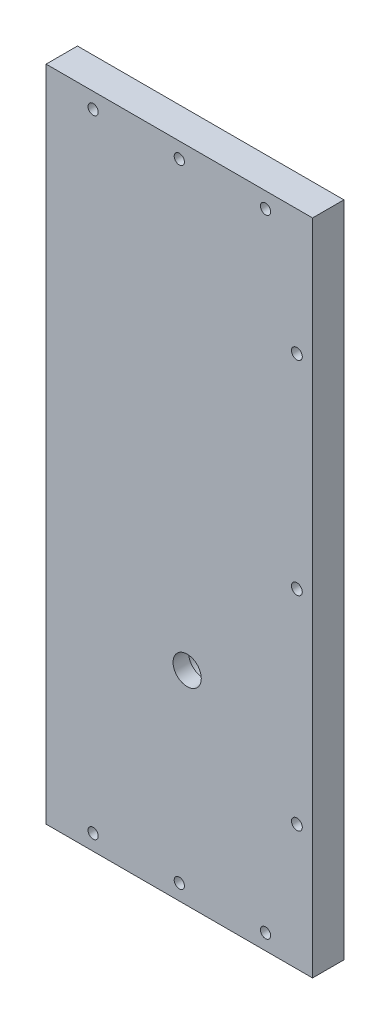
ISO-10303-21;
HEADER;
FILE_DESCRIPTION(('STEP AP214'),'2;1');
FILE_NAME('part.step','',(''),(''),'','','');
FILE_SCHEMA(('AUTOMOTIVE_DESIGN { 1 0 10303 214 1 1 1 1 }'));
ENDSEC;
DATA;
#1=APPLICATION_CONTEXT('core data for automotive mechanical design processes');
#2=APPLICATION_PROTOCOL_DEFINITION('international standard','automotive_design',2000,#1);
#3=PRODUCT_CONTEXT('',#1,'mechanical');
#4=PRODUCT('Part','Part','',(#3));
#5=PRODUCT_RELATED_PRODUCT_CATEGORY('part','',(#4));
#6=PRODUCT_DEFINITION_FORMATION('','',#4);
#7=PRODUCT_DEFINITION_CONTEXT('part definition',#1,'design');
#8=PRODUCT_DEFINITION('design','',#6,#7);
#9=PRODUCT_DEFINITION_SHAPE('','',#8);
#10=(LENGTH_UNIT() NAMED_UNIT(*) SI_UNIT(.MILLI.,.METRE.));
#11=(NAMED_UNIT(*) PLANE_ANGLE_UNIT() SI_UNIT($,.RADIAN.));
#12=(NAMED_UNIT(*) SI_UNIT($,.STERADIAN.) SOLID_ANGLE_UNIT());
#13=UNCERTAINTY_MEASURE_WITH_UNIT(LENGTH_MEASURE(1.E-05),#10,'distance_accuracy_value','');
#14=(GEOMETRIC_REPRESENTATION_CONTEXT(3) GLOBAL_UNCERTAINTY_ASSIGNED_CONTEXT((#13)) GLOBAL_UNIT_ASSIGNED_CONTEXT((#10,
#11,#12)) REPRESENTATION_CONTEXT('',''));
#15=CARTESIAN_POINT('',(0.,0.,0.));
#16=DIRECTION('',(0.,0.,1.));
#17=DIRECTION('',(1.,0.,0.));
#18=AXIS2_PLACEMENT_3D('',#15,#16,#17);
#19=CARTESIAN_POINT('',(0.,0.,0.));
#20=DIRECTION('',(0.,0.,1.));
#21=DIRECTION('',(1.,0.,0.));
#22=AXIS2_PLACEMENT_3D('',#19,#20,#21);
#23=PLANE('',#22);
#24=CARTESIAN_POINT('',(-113.363171355499,-53.1585677749361,0.));
#25=DIRECTION('',(0.,0.,-1.));
#26=DIRECTION('',(-1.,0.,0.));
#27=AXIS2_PLACEMENT_3D('',#24,#25,#26);
#28=CIRCLE('',#27,6.35);
#29=CARTESIAN_POINT('',(-119.713171355499,-53.1585677749361,0.));
#30=VERTEX_POINT('',#29);
#31=EDGE_CURVE('E143',#30,#30,#28,.T.);
#32=ORIENTED_EDGE('',*,*,#31,.F.);
#33=EDGE_LOOP('',(#32));
#34=FACE_BOUND('',#33,.T.);
#35=CARTESIAN_POINT('',(-88.3631713554986,86.8414322250639,0.));
#36=DIRECTION('',(0.,0.,-1.));
#37=DIRECTION('',(-1.,0.,0.));
#38=AXIS2_PLACEMENT_3D('',#35,#36,#37);
#39=CIRCLE('',#38,3.37311999999999);
#40=CARTESIAN_POINT('',(-91.7362913554986,86.8414322250639,0.));
#41=VERTEX_POINT('',#40);
#42=EDGE_CURVE('E151',#41,#41,#39,.T.);
#43=ORIENTED_EDGE('',*,*,#42,.F.);
#44=EDGE_LOOP('',(#43));
#45=FACE_BOUND('',#44,.T.);
#46=CARTESIAN_POINT('',(-115.863171355499,86.841432225064,0.));
#47=DIRECTION('',(0.,0.,-1.));
#48=DIRECTION('',(-1.,0.,0.));
#49=AXIS2_PLACEMENT_3D('',#46,#47,#48);
#50=CIRCLE('',#49,3.37311999999999);
#51=CARTESIAN_POINT('',(-119.236291355499,86.841432225064,0.));
#52=VERTEX_POINT('',#51);
#53=EDGE_CURVE('E170',#52,#52,#50,.T.);
#54=ORIENTED_EDGE('',*,*,#53,.F.);
#55=EDGE_LOOP('',(#54));
#56=FACE_BOUND('',#55,.T.);
#57=CARTESIAN_POINT('',(-143.363171355499,86.841432225064,0.));
#58=DIRECTION('',(0.,0.,-1.));
#59=DIRECTION('',(-1.,0.,0.));
#60=AXIS2_PLACEMENT_3D('',#57,#58,#59);
#61=CIRCLE('',#60,3.37311999999998);
#62=CARTESIAN_POINT('',(-146.736291355498,86.841432225064,0.));
#63=VERTEX_POINT('',#62);
#64=EDGE_CURVE('E186',#63,#63,#61,.T.);
#65=ORIENTED_EDGE('',*,*,#64,.F.);
#66=EDGE_LOOP('',(#65));
#67=FACE_BOUND('',#66,.T.);
#68=CARTESIAN_POINT('',(-143.363171355499,-113.158567774936,0.));
#69=DIRECTION('',(0.,0.,-1.));
#70=DIRECTION('',(-1.,0.,0.));
#71=AXIS2_PLACEMENT_3D('',#68,#69,#70);
#72=CIRCLE('',#71,3.37312000000001);
#73=CARTESIAN_POINT('',(-146.736291355499,-113.158567774936,0.));
#74=VERTEX_POINT('',#73);
#75=EDGE_CURVE('E202',#74,#74,#72,.T.);
#76=ORIENTED_EDGE('',*,*,#75,.F.);
#77=EDGE_LOOP('',(#76));
#78=FACE_BOUND('',#77,.T.);
#79=CARTESIAN_POINT('',(-115.863171355499,-113.158567774936,0.));
#80=DIRECTION('',(0.,0.,-1.));
#81=DIRECTION('',(-1.,0.,0.));
#82=AXIS2_PLACEMENT_3D('',#79,#80,#81);
#83=CIRCLE('',#82,3.37311999999999);
#84=CARTESIAN_POINT('',(-119.236291355499,-113.158567774936,0.));
#85=VERTEX_POINT('',#84);
#86=EDGE_CURVE('E218',#85,#85,#83,.T.);
#87=ORIENTED_EDGE('',*,*,#86,.F.);
#88=EDGE_LOOP('',(#87));
#89=FACE_BOUND('',#88,.T.);
#90=CARTESIAN_POINT('',(-88.3631713554987,-113.158567774936,0.));
#91=DIRECTION('',(0.,0.,-1.));
#92=DIRECTION('',(-1.,0.,0.));
#93=AXIS2_PLACEMENT_3D('',#90,#91,#92);
#94=CIRCLE('',#93,3.37311999999999);
#95=CARTESIAN_POINT('',(-91.7362913554986,-113.158567774936,0.));
#96=VERTEX_POINT('',#95);
#97=EDGE_CURVE('E234',#96,#96,#94,.T.);
#98=ORIENTED_EDGE('',*,*,#97,.F.);
#99=EDGE_LOOP('',(#98));
#100=FACE_BOUND('',#99,.T.);
#101=CARTESIAN_POINT('',(-78.3631713554987,51.8414322250639,0.));
#102=DIRECTION('',(0.,0.,-1.));
#103=DIRECTION('',(-1.,0.,0.));
#104=AXIS2_PLACEMENT_3D('',#101,#102,#103);
#105=CIRCLE('',#104,3.37311999999999);
#106=CARTESIAN_POINT('',(-81.7362913554987,51.8414322250639,0.));
#107=VERTEX_POINT('',#106);
#108=EDGE_CURVE('E250',#107,#107,#105,.T.);
#109=ORIENTED_EDGE('',*,*,#108,.F.);
#110=EDGE_LOOP('',(#109));
#111=FACE_BOUND('',#110,.T.);
#112=CARTESIAN_POINT('',(-78.3631713554987,-78.1585677749361,0.));
#113=DIRECTION('',(0.,0.,-1.));
#114=DIRECTION('',(-1.,0.,0.));
#115=AXIS2_PLACEMENT_3D('',#112,#113,#114);
#116=CIRCLE('',#115,3.37311999999999);
#117=CARTESIAN_POINT('',(-81.7362913554987,-78.1585677749361,0.));
#118=VERTEX_POINT('',#117);
#119=EDGE_CURVE('E282',#118,#118,#116,.T.);
#120=ORIENTED_EDGE('',*,*,#119,.F.);
#121=EDGE_LOOP('',(#120));
#122=FACE_BOUND('',#121,.T.);
#123=DIRECTION('',(0.,-1.,0.));
#124=VECTOR('',#123,1.);
#125=CARTESIAN_POINT('',(-158.363171355499,91.8414322250639,0.));
#126=LINE('',#125,#124);
#127=CARTESIAN_POINT('',(-158.363171355499,91.8414322250639,0.));
#128=VERTEX_POINT('',#127);
#129=CARTESIAN_POINT('',(-158.363171355499,-118.158567774936,0.));
#130=VERTEX_POINT('',#129);
#131=EDGE_CURVE('E298',#128,#130,#126,.T.);
#132=ORIENTED_EDGE('',*,*,#131,.F.);
#133=DIRECTION('',(-1.,0.,0.));
#134=VECTOR('',#133,1.);
#135=CARTESIAN_POINT('',(-158.363171355499,91.8414322250639,0.));
#136=LINE('',#135,#134);
#137=CARTESIAN_POINT('',(-73.3631713554987,91.8414322250639,0.));
#138=VERTEX_POINT('',#137);
#139=EDGE_CURVE('E99',#138,#128,#136,.T.);
#140=ORIENTED_EDGE('',*,*,#139,.F.);
#141=DIRECTION('',(0.,1.,0.));
#142=VECTOR('',#141,1.);
#143=CARTESIAN_POINT('',(-73.3631713554987,91.8414322250639,0.));
#144=LINE('',#143,#142);
#145=CARTESIAN_POINT('',(-73.3631713554987,-118.158567774936,0.));
#146=VERTEX_POINT('',#145);
#147=EDGE_CURVE('E93',#146,#138,#144,.T.);
#148=ORIENTED_EDGE('',*,*,#147,.F.);
#149=DIRECTION('',(1.,0.,0.));
#150=VECTOR('',#149,1.);
#151=CARTESIAN_POINT('',(-158.363171355499,-118.158567774936,0.));
#152=LINE('',#151,#150);
#153=EDGE_CURVE('E313',#130,#146,#152,.T.);
#154=ORIENTED_EDGE('',*,*,#153,.F.);
#155=EDGE_LOOP('',(#132,#140,#148,#154));
#156=FACE_BOUND('',#155,.T.);
#157=CARTESIAN_POINT('',(-78.3631713554987,-13.1585677749361,0.));
#158=DIRECTION('',(0.,0.,-1.));
#159=DIRECTION('',(-1.,0.,0.));
#160=AXIS2_PLACEMENT_3D('',#157,#158,#159);
#161=CIRCLE('',#160,3.37311999999999);
#162=CARTESIAN_POINT('',(-81.7362913554987,-13.1585677749361,0.));
#163=VERTEX_POINT('',#162);
#164=EDGE_CURVE('E266',#163,#163,#161,.T.);
#165=ORIENTED_EDGE('',*,*,#164,.F.);
#166=EDGE_LOOP('',(#165));
#167=FACE_BOUND('',#166,.T.);
#168=ADVANCED_FACE('F57',(#34,#45,#56,#67,#78,#89,#100,#111,#122,#156,#167),#23,.F.);
#169=CARTESIAN_POINT('',(-158.363171355499,91.8414322250639,10.));
#170=DIRECTION('',(1.,0.,0.));
#171=DIRECTION('',(0.,1.,0.));
#172=AXIS2_PLACEMENT_3D('',#169,#170,#171);
#173=PLANE('',#172);
#174=CARTESIAN_POINT('',(-158.363171355499,-63.1585677749361,5.00000000000001));
#175=DIRECTION('',(-1.,0.,0.));
#176=DIRECTION('',(0.,0.,1.));
#177=AXIS2_PLACEMENT_3D('',#174,#175,#176);
#178=CIRCLE('',#177,1.13029999999999);
#179=CARTESIAN_POINT('',(-158.363171355499,-63.1585677749361,6.13029999999999));
#180=VERTEX_POINT('',#179);
#181=EDGE_CURVE('E125',#180,#180,#178,.T.);
#182=ORIENTED_EDGE('',*,*,#181,.F.);
#183=EDGE_LOOP('',(#182));
#184=FACE_BOUND('',#183,.T.);
#185=CARTESIAN_POINT('',(-158.363171355499,36.8414322250639,5.00000000000001));
#186=DIRECTION('',(-1.,0.,0.));
#187=DIRECTION('',(0.,0.,1.));
#188=AXIS2_PLACEMENT_3D('',#185,#186,#187);
#189=CIRCLE('',#188,1.13029999999999);
#190=CARTESIAN_POINT('',(-158.363171355499,36.8414322250639,6.13029999999999));
#191=VERTEX_POINT('',#190);
#192=EDGE_CURVE('E124',#191,#191,#189,.T.);
#193=ORIENTED_EDGE('',*,*,#192,.F.);
#194=EDGE_LOOP('',(#193));
#195=FACE_BOUND('',#194,.T.);
#196=ORIENTED_EDGE('',*,*,#131,.T.);
#197=DIRECTION('',(0.,0.,-1.));
#198=VECTOR('',#197,1.);
#199=CARTESIAN_POINT('',(-158.363171355499,-118.158567774936,10.));
#200=LINE('',#199,#198);
#201=CARTESIAN_POINT('',(-158.363171355499,-118.158567774936,10.));
#202=VERTEX_POINT('',#201);
#203=EDGE_CURVE('E13',#202,#130,#200,.T.);
#204=ORIENTED_EDGE('',*,*,#203,.F.);
#205=DIRECTION('',(0.,-1.,0.));
#206=VECTOR('',#205,1.);
#207=CARTESIAN_POINT('',(-158.363171355499,91.8414322250639,10.));
#208=LINE('',#207,#206);
#209=CARTESIAN_POINT('',(-158.363171355499,91.8414322250639,10.));
#210=VERTEX_POINT('',#209);
#211=EDGE_CURVE('E299',#210,#202,#208,.T.);
#212=ORIENTED_EDGE('',*,*,#211,.F.);
#213=DIRECTION('',(0.,0.,-1.));
#214=VECTOR('',#213,1.);
#215=CARTESIAN_POINT('',(-158.363171355499,91.8414322250639,10.));
#216=LINE('',#215,#214);
#217=EDGE_CURVE('E309',#210,#128,#216,.T.);
#218=ORIENTED_EDGE('',*,*,#217,.T.);
#219=EDGE_LOOP('',(#196,#204,#212,#218));
#220=FACE_BOUND('',#219,.T.);
#221=ADVANCED_FACE('F59',(#184,#195,#220),#173,.F.);
#222=CARTESIAN_POINT('',(-158.363171355499,-118.158567774936,10.));
#223=DIRECTION('',(0.,1.,0.));
#224=DIRECTION('',(0.,0.,1.));
#225=AXIS2_PLACEMENT_3D('',#222,#223,#224);
#226=PLANE('',#225);
#227=ORIENTED_EDGE('',*,*,#153,.T.);
#228=DIRECTION('',(0.,0.,-1.));
#229=VECTOR('',#228,1.);
#230=CARTESIAN_POINT('',(-73.3631713554987,-118.158567774936,10.));
#231=LINE('',#230,#229);
#232=CARTESIAN_POINT('',(-73.3631713554987,-118.158567774936,10.));
#233=VERTEX_POINT('',#232);
#234=EDGE_CURVE('E67',#233,#146,#231,.T.);
#235=ORIENTED_EDGE('',*,*,#234,.F.);
#236=DIRECTION('',(1.,0.,0.));
#237=VECTOR('',#236,1.);
#238=CARTESIAN_POINT('',(-158.363171355499,-118.158567774936,10.));
#239=LINE('',#238,#237);
#240=EDGE_CURVE('E106',#202,#233,#239,.T.);
#241=ORIENTED_EDGE('',*,*,#240,.F.);
#242=ORIENTED_EDGE('',*,*,#203,.T.);
#243=EDGE_LOOP('',(#227,#235,#241,#242));
#244=FACE_BOUND('',#243,.T.);
#245=ADVANCED_FACE('F344',(#244),#226,.F.);
#246=CARTESIAN_POINT('',(-73.3631713554987,91.8414322250639,10.));
#247=DIRECTION('',(-1.,0.,0.));
#248=DIRECTION('',(0.,-1.,0.));
#249=AXIS2_PLACEMENT_3D('',#246,#247,#248);
#250=PLANE('',#249);
#251=ORIENTED_EDGE('',*,*,#147,.T.);
#252=DIRECTION('',(0.,0.,-1.));
#253=VECTOR('',#252,1.);
#254=CARTESIAN_POINT('',(-73.3631713554987,91.8414322250639,10.));
#255=LINE('',#254,#253);
#256=CARTESIAN_POINT('',(-73.3631713554987,91.8414322250639,10.));
#257=VERTEX_POINT('',#256);
#258=EDGE_CURVE('E322',#257,#138,#255,.T.);
#259=ORIENTED_EDGE('',*,*,#258,.F.);
#260=DIRECTION('',(0.,1.,0.));
#261=VECTOR('',#260,1.);
#262=CARTESIAN_POINT('',(-73.3631713554987,91.8414322250639,10.));
#263=LINE('',#262,#261);
#264=EDGE_CURVE('E304',#233,#257,#263,.T.);
#265=ORIENTED_EDGE('',*,*,#264,.F.);
#266=ORIENTED_EDGE('',*,*,#234,.T.);
#267=EDGE_LOOP('',(#251,#259,#265,#266));
#268=FACE_BOUND('',#267,.T.);
#269=ADVANCED_FACE('F326',(#268),#250,.F.);
#270=CARTESIAN_POINT('',(-158.363171355499,91.8414322250639,10.));
#271=DIRECTION('',(0.,-1.,0.));
#272=DIRECTION('',(0.,0.,-1.));
#273=AXIS2_PLACEMENT_3D('',#270,#271,#272);
#274=PLANE('',#273);
#275=ORIENTED_EDGE('',*,*,#139,.T.);
#276=ORIENTED_EDGE('',*,*,#217,.F.);
#277=DIRECTION('',(-1.,0.,0.));
#278=VECTOR('',#277,1.);
#279=CARTESIAN_POINT('',(-158.363171355499,91.8414322250639,10.));
#280=LINE('',#279,#278);
#281=EDGE_CURVE('E75',#257,#210,#280,.T.);
#282=ORIENTED_EDGE('',*,*,#281,.F.);
#283=ORIENTED_EDGE('',*,*,#258,.T.);
#284=EDGE_LOOP('',(#275,#276,#282,#283));
#285=FACE_BOUND('',#284,.T.);
#286=ADVANCED_FACE('F333',(#285),#274,.F.);
#287=CARTESIAN_POINT('',(0.,0.,10.));
#288=DIRECTION('',(0.,0.,1.));
#289=DIRECTION('',(1.,0.,0.));
#290=AXIS2_PLACEMENT_3D('',#287,#288,#289);
#291=PLANE('',#290);
#292=CARTESIAN_POINT('',(-113.363171355499,-53.1585677749361,10.));
#293=DIRECTION('',(0.,0.,1.));
#294=DIRECTION('',(1.,0.,0.));
#295=AXIS2_PLACEMENT_3D('',#292,#293,#294);
#296=CIRCLE('',#295,4.49999999999999);
#297=CARTESIAN_POINT('',(-108.863171355499,-53.1585677749361,10.));
#298=VERTEX_POINT('',#297);
#299=EDGE_CURVE('E138',#298,#298,#296,.F.);
#300=ORIENTED_EDGE('',*,*,#299,.T.);
#301=EDGE_LOOP('',(#300));
#302=FACE_BOUND('',#301,.T.);
#303=CARTESIAN_POINT('',(-88.3631713554986,86.8414322250639,10.));
#304=DIRECTION('',(0.,0.,1.));
#305=DIRECTION('',(1.,0.,0.));
#306=AXIS2_PLACEMENT_3D('',#303,#304,#305);
#307=CIRCLE('',#306,1.63195);
#308=CARTESIAN_POINT('',(-86.7312213554986,86.8414322250639,10.));
#309=VERTEX_POINT('',#308);
#310=EDGE_CURVE('E166',#309,#309,#307,.T.);
#311=ORIENTED_EDGE('',*,*,#310,.F.);
#312=EDGE_LOOP('',(#311));
#313=FACE_BOUND('',#312,.T.);
#314=CARTESIAN_POINT('',(-115.863171355499,86.841432225064,10.));
#315=DIRECTION('',(0.,0.,1.));
#316=DIRECTION('',(1.,0.,0.));
#317=AXIS2_PLACEMENT_3D('',#314,#315,#316);
#318=CIRCLE('',#317,1.63195);
#319=CARTESIAN_POINT('',(-114.231221355499,86.841432225064,10.));
#320=VERTEX_POINT('',#319);
#321=EDGE_CURVE('E182',#320,#320,#318,.T.);
#322=ORIENTED_EDGE('',*,*,#321,.F.);
#323=EDGE_LOOP('',(#322));
#324=FACE_BOUND('',#323,.T.);
#325=CARTESIAN_POINT('',(-143.363171355499,86.841432225064,10.));
#326=DIRECTION('',(0.,0.,1.));
#327=DIRECTION('',(1.,0.,0.));
#328=AXIS2_PLACEMENT_3D('',#325,#326,#327);
#329=CIRCLE('',#328,1.63194999999999);
#330=CARTESIAN_POINT('',(-141.731221355499,86.841432225064,10.));
#331=VERTEX_POINT('',#330);
#332=EDGE_CURVE('E198',#331,#331,#329,.T.);
#333=ORIENTED_EDGE('',*,*,#332,.F.);
#334=EDGE_LOOP('',(#333));
#335=FACE_BOUND('',#334,.T.);
#336=CARTESIAN_POINT('',(-143.363171355499,-113.158567774936,10.));
#337=DIRECTION('',(0.,0.,1.));
#338=DIRECTION('',(1.,0.,0.));
#339=AXIS2_PLACEMENT_3D('',#336,#337,#338);
#340=CIRCLE('',#339,1.63194999999999);
#341=CARTESIAN_POINT('',(-141.731221355499,-113.158567774936,10.));
#342=VERTEX_POINT('',#341);
#343=EDGE_CURVE('E214',#342,#342,#340,.T.);
#344=ORIENTED_EDGE('',*,*,#343,.F.);
#345=EDGE_LOOP('',(#344));
#346=FACE_BOUND('',#345,.T.);
#347=CARTESIAN_POINT('',(-115.863171355499,-113.158567774936,10.));
#348=DIRECTION('',(0.,0.,1.));
#349=DIRECTION('',(1.,0.,0.));
#350=AXIS2_PLACEMENT_3D('',#347,#348,#349);
#351=CIRCLE('',#350,1.63195);
#352=CARTESIAN_POINT('',(-114.231221355499,-113.158567774936,10.));
#353=VERTEX_POINT('',#352);
#354=EDGE_CURVE('E230',#353,#353,#351,.T.);
#355=ORIENTED_EDGE('',*,*,#354,.F.);
#356=EDGE_LOOP('',(#355));
#357=FACE_BOUND('',#356,.T.);
#358=CARTESIAN_POINT('',(-88.3631713554987,-113.158567774936,10.));
#359=DIRECTION('',(0.,0.,1.));
#360=DIRECTION('',(1.,0.,0.));
#361=AXIS2_PLACEMENT_3D('',#358,#359,#360);
#362=CIRCLE('',#361,1.63195);
#363=CARTESIAN_POINT('',(-86.7312213554987,-113.158567774936,10.));
#364=VERTEX_POINT('',#363);
#365=EDGE_CURVE('E246',#364,#364,#362,.T.);
#366=ORIENTED_EDGE('',*,*,#365,.F.);
#367=EDGE_LOOP('',(#366));
#368=FACE_BOUND('',#367,.T.);
#369=CARTESIAN_POINT('',(-78.3631713554987,51.8414322250639,10.));
#370=DIRECTION('',(0.,0.,-1.));
#371=DIRECTION('',(-1.,0.,0.));
#372=AXIS2_PLACEMENT_3D('',#369,#370,#371);
#373=CIRCLE('',#372,1.7272);
#374=CARTESIAN_POINT('',(-80.0903713554986,51.8414322250639,10.));
#375=VERTEX_POINT('',#374);
#376=EDGE_CURVE('E262',#375,#375,#373,.T.);
#377=ORIENTED_EDGE('',*,*,#376,.T.);
#378=EDGE_LOOP('',(#377));
#379=FACE_BOUND('',#378,.T.);
#380=CARTESIAN_POINT('',(-78.3631713554987,-13.1585677749361,10.));
#381=DIRECTION('',(0.,0.,-1.));
#382=DIRECTION('',(-1.,0.,0.));
#383=AXIS2_PLACEMENT_3D('',#380,#381,#382);
#384=CIRCLE('',#383,1.7272);
#385=CARTESIAN_POINT('',(-80.0903713554986,-13.1585677749361,10.));
#386=VERTEX_POINT('',#385);
#387=EDGE_CURVE('E278',#386,#386,#384,.T.);
#388=ORIENTED_EDGE('',*,*,#387,.T.);
#389=EDGE_LOOP('',(#388));
#390=FACE_BOUND('',#389,.T.);
#391=CARTESIAN_POINT('',(-78.3631713554987,-78.1585677749361,10.));
#392=DIRECTION('',(0.,0.,-1.));
#393=DIRECTION('',(-1.,0.,0.));
#394=AXIS2_PLACEMENT_3D('',#391,#392,#393);
#395=CIRCLE('',#394,1.7272);
#396=CARTESIAN_POINT('',(-80.0903713554986,-78.1585677749361,10.));
#397=VERTEX_POINT('',#396);
#398=EDGE_CURVE('E294',#397,#397,#395,.T.);
#399=ORIENTED_EDGE('',*,*,#398,.T.);
#400=EDGE_LOOP('',(#399));
#401=FACE_BOUND('',#400,.T.);
#402=ORIENTED_EDGE('',*,*,#211,.T.);
#403=ORIENTED_EDGE('',*,*,#240,.T.);
#404=ORIENTED_EDGE('',*,*,#264,.T.);
#405=ORIENTED_EDGE('',*,*,#281,.T.);
#406=EDGE_LOOP('',(#402,#403,#404,#405));
#407=FACE_BOUND('',#406,.T.);
#408=ADVANCED_FACE('F335',(#302,#313,#324,#335,#346,#357,#368,#379,#390,#401,#407),#291,.T.);
#409=CARTESIAN_POINT('',(-78.3631713554987,-78.1585677749361,0.));
#410=DIRECTION('',(0.,0.,-1.));
#411=DIRECTION('',(-1.,0.,0.));
#412=AXIS2_PLACEMENT_3D('',#409,#410,#411);
#413=CYLINDRICAL_SURFACE('',#412,1.7272);
#414=ORIENTED_EDGE('',*,*,#398,.F.);
#415=EDGE_LOOP('',(#414));
#416=FACE_BOUND('',#415,.T.);
#417=CARTESIAN_POINT('',(-78.3631713554987,-78.1585677749361,1.7272));
#418=DIRECTION('',(0.,0.,-1.));
#419=DIRECTION('',(-1.,0.,0.));
#420=AXIS2_PLACEMENT_3D('',#417,#418,#419);
#421=CIRCLE('',#420,1.7272);
#422=CARTESIAN_POINT('',(-80.0903713554986,-78.1585677749361,1.7272));
#423=VERTEX_POINT('',#422);
#424=EDGE_CURVE('E290',#423,#423,#421,.T.);
#425=ORIENTED_EDGE('',*,*,#424,.T.);
#426=EDGE_LOOP('',(#425));
#427=FACE_BOUND('',#426,.T.);
#428=ADVANCED_FACE('F341',(#416,#427),#413,.F.);
#429=CARTESIAN_POINT('',(-76.6359713554987,-78.1585677749361,1.7272));
#430=DIRECTION('',(0.,0.,1.));
#431=DIRECTION('',(1.,0.,0.));
#432=AXIS2_PLACEMENT_3D('',#429,#430,#431);
#433=PLANE('',#432);
#434=ORIENTED_EDGE('',*,*,#424,.F.);
#435=EDGE_LOOP('',(#434));
#436=FACE_BOUND('',#435,.T.);
#437=CARTESIAN_POINT('',(-78.3631713554987,-78.1585677749361,1.7272));
#438=DIRECTION('',(0.,0.,-1.));
#439=DIRECTION('',(-1.,0.,0.));
#440=AXIS2_PLACEMENT_3D('',#437,#438,#439);
#441=CIRCLE('',#440,3.37311999999999);
#442=CARTESIAN_POINT('',(-81.7362913554987,-78.1585677749361,1.7272));
#443=VERTEX_POINT('',#442);
#444=EDGE_CURVE('E286',#443,#443,#441,.T.);
#445=ORIENTED_EDGE('',*,*,#444,.T.);
#446=EDGE_LOOP('',(#445));
#447=FACE_BOUND('',#446,.T.);
#448=ADVANCED_FACE('F358',(#436,#447),#433,.F.);
#449=CARTESIAN_POINT('',(-78.3631713554987,-78.1585677749361,0.));
#450=DIRECTION('',(0.,0.,-1.));
#451=DIRECTION('',(-1.,0.,0.));
#452=AXIS2_PLACEMENT_3D('',#449,#450,#451);
#453=CYLINDRICAL_SURFACE('',#452,3.37311999999999);
#454=ORIENTED_EDGE('',*,*,#444,.F.);
#455=EDGE_LOOP('',(#454));
#456=FACE_BOUND('',#455,.T.);
#457=ORIENTED_EDGE('',*,*,#119,.T.);
#458=EDGE_LOOP('',(#457));
#459=FACE_BOUND('',#458,.T.);
#460=ADVANCED_FACE('F362',(#456,#459),#453,.F.);
#461=CARTESIAN_POINT('',(-78.3631713554987,-13.1585677749361,0.));
#462=DIRECTION('',(0.,0.,-1.));
#463=DIRECTION('',(-1.,0.,0.));
#464=AXIS2_PLACEMENT_3D('',#461,#462,#463);
#465=CYLINDRICAL_SURFACE('',#464,1.7272);
#466=ORIENTED_EDGE('',*,*,#387,.F.);
#467=EDGE_LOOP('',(#466));
#468=FACE_BOUND('',#467,.T.);
#469=CARTESIAN_POINT('',(-78.3631713554987,-13.1585677749361,1.7272));
#470=DIRECTION('',(0.,0.,-1.));
#471=DIRECTION('',(-1.,0.,0.));
#472=AXIS2_PLACEMENT_3D('',#469,#470,#471);
#473=CIRCLE('',#472,1.7272);
#474=CARTESIAN_POINT('',(-80.0903713554986,-13.1585677749361,1.7272));
#475=VERTEX_POINT('',#474);
#476=EDGE_CURVE('E274',#475,#475,#473,.T.);
#477=ORIENTED_EDGE('',*,*,#476,.T.);
#478=EDGE_LOOP('',(#477));
#479=FACE_BOUND('',#478,.T.);
#480=ADVANCED_FACE('F366',(#468,#479),#465,.F.);
#481=CARTESIAN_POINT('',(-76.6359713554987,-13.1585677749361,1.7272));
#482=DIRECTION('',(0.,0.,1.));
#483=DIRECTION('',(1.,0.,0.));
#484=AXIS2_PLACEMENT_3D('',#481,#482,#483);
#485=PLANE('',#484);
#486=ORIENTED_EDGE('',*,*,#476,.F.);
#487=EDGE_LOOP('',(#486));
#488=FACE_BOUND('',#487,.T.);
#489=CARTESIAN_POINT('',(-78.3631713554987,-13.1585677749361,1.7272));
#490=DIRECTION('',(0.,0.,-1.));
#491=DIRECTION('',(-1.,0.,0.));
#492=AXIS2_PLACEMENT_3D('',#489,#490,#491);
#493=CIRCLE('',#492,3.37311999999999);
#494=CARTESIAN_POINT('',(-81.7362913554987,-13.1585677749361,1.7272));
#495=VERTEX_POINT('',#494);
#496=EDGE_CURVE('E270',#495,#495,#493,.T.);
#497=ORIENTED_EDGE('',*,*,#496,.T.);
#498=EDGE_LOOP('',(#497));
#499=FACE_BOUND('',#498,.T.);
#500=ADVANCED_FACE('F370',(#488,#499),#485,.F.);
#501=CARTESIAN_POINT('',(-78.3631713554987,-13.1585677749361,0.));
#502=DIRECTION('',(0.,0.,-1.));
#503=DIRECTION('',(-1.,0.,0.));
#504=AXIS2_PLACEMENT_3D('',#501,#502,#503);
#505=CYLINDRICAL_SURFACE('',#504,3.37311999999999);
#506=ORIENTED_EDGE('',*,*,#496,.F.);
#507=EDGE_LOOP('',(#506));
#508=FACE_BOUND('',#507,.T.);
#509=ORIENTED_EDGE('',*,*,#164,.T.);
#510=EDGE_LOOP('',(#509));
#511=FACE_BOUND('',#510,.T.);
#512=ADVANCED_FACE('F374',(#508,#511),#505,.F.);
#513=CARTESIAN_POINT('',(-78.3631713554987,51.8414322250639,0.));
#514=DIRECTION('',(0.,0.,-1.));
#515=DIRECTION('',(-1.,0.,0.));
#516=AXIS2_PLACEMENT_3D('',#513,#514,#515);
#517=CYLINDRICAL_SURFACE('',#516,1.7272);
#518=ORIENTED_EDGE('',*,*,#376,.F.);
#519=EDGE_LOOP('',(#518));
#520=FACE_BOUND('',#519,.T.);
#521=CARTESIAN_POINT('',(-78.3631713554987,51.8414322250639,1.7272));
#522=DIRECTION('',(0.,0.,-1.));
#523=DIRECTION('',(-1.,0.,0.));
#524=AXIS2_PLACEMENT_3D('',#521,#522,#523);
#525=CIRCLE('',#524,1.7272);
#526=CARTESIAN_POINT('',(-80.0903713554986,51.8414322250639,1.7272));
#527=VERTEX_POINT('',#526);
#528=EDGE_CURVE('E258',#527,#527,#525,.T.);
#529=ORIENTED_EDGE('',*,*,#528,.T.);
#530=EDGE_LOOP('',(#529));
#531=FACE_BOUND('',#530,.T.);
#532=ADVANCED_FACE('F378',(#520,#531),#517,.F.);
#533=CARTESIAN_POINT('',(-76.6359713554987,51.8414322250639,1.7272));
#534=DIRECTION('',(0.,0.,1.));
#535=DIRECTION('',(1.,0.,0.));
#536=AXIS2_PLACEMENT_3D('',#533,#534,#535);
#537=PLANE('',#536);
#538=ORIENTED_EDGE('',*,*,#528,.F.);
#539=EDGE_LOOP('',(#538));
#540=FACE_BOUND('',#539,.T.);
#541=CARTESIAN_POINT('',(-78.3631713554987,51.8414322250639,1.7272));
#542=DIRECTION('',(0.,0.,-1.));
#543=DIRECTION('',(-1.,0.,0.));
#544=AXIS2_PLACEMENT_3D('',#541,#542,#543);
#545=CIRCLE('',#544,3.37311999999999);
#546=CARTESIAN_POINT('',(-81.7362913554987,51.8414322250639,1.7272));
#547=VERTEX_POINT('',#546);
#548=EDGE_CURVE('E254',#547,#547,#545,.T.);
#549=ORIENTED_EDGE('',*,*,#548,.T.);
#550=EDGE_LOOP('',(#549));
#551=FACE_BOUND('',#550,.T.);
#552=ADVANCED_FACE('F382',(#540,#551),#537,.F.);
#553=CARTESIAN_POINT('',(-78.3631713554987,51.8414322250639,0.));
#554=DIRECTION('',(0.,0.,-1.));
#555=DIRECTION('',(-1.,0.,0.));
#556=AXIS2_PLACEMENT_3D('',#553,#554,#555);
#557=CYLINDRICAL_SURFACE('',#556,3.37311999999999);
#558=ORIENTED_EDGE('',*,*,#548,.F.);
#559=EDGE_LOOP('',(#558));
#560=FACE_BOUND('',#559,.T.);
#561=ORIENTED_EDGE('',*,*,#108,.T.);
#562=EDGE_LOOP('',(#561));
#563=FACE_BOUND('',#562,.T.);
#564=ADVANCED_FACE('F386',(#560,#563),#557,.F.);
#565=CARTESIAN_POINT('',(-88.3631713554987,-113.158567774936,0.));
#566=DIRECTION('',(0.,0.,-1.));
#567=DIRECTION('',(-1.,0.,0.));
#568=AXIS2_PLACEMENT_3D('',#565,#566,#567);
#569=CYLINDRICAL_SURFACE('',#568,1.63195);
#570=CARTESIAN_POINT('',(-88.3631713554987,-113.158567774936,1.7272));
#571=DIRECTION('',(0.,0.,-1.));
#572=DIRECTION('',(-1.,0.,0.));
#573=AXIS2_PLACEMENT_3D('',#570,#571,#572);
#574=CIRCLE('',#573,1.63195000000001);
#575=CARTESIAN_POINT('',(-89.9951213554987,-113.158567774936,1.7272));
#576=VERTEX_POINT('',#575);
#577=EDGE_CURVE('E242',#576,#576,#574,.T.);
#578=ORIENTED_EDGE('',*,*,#577,.T.);
#579=EDGE_LOOP('',(#578));
#580=FACE_BOUND('',#579,.T.);
#581=ORIENTED_EDGE('',*,*,#365,.T.);
#582=EDGE_LOOP('',(#581));
#583=FACE_BOUND('',#582,.T.);
#584=ADVANCED_FACE('F390',(#580,#583),#569,.F.);
#585=CARTESIAN_POINT('',(-86.7312213554986,-113.158567774936,1.7272));
#586=DIRECTION('',(0.,0.,1.));
#587=DIRECTION('',(1.,0.,0.));
#588=AXIS2_PLACEMENT_3D('',#585,#586,#587);
#589=PLANE('',#588);
#590=ORIENTED_EDGE('',*,*,#577,.F.);
#591=EDGE_LOOP('',(#590));
#592=FACE_BOUND('',#591,.T.);
#593=CARTESIAN_POINT('',(-88.3631713554987,-113.158567774936,1.7272));
#594=DIRECTION('',(0.,0.,-1.));
#595=DIRECTION('',(-1.,0.,0.));
#596=AXIS2_PLACEMENT_3D('',#593,#594,#595);
#597=CIRCLE('',#596,3.37311999999999);
#598=CARTESIAN_POINT('',(-91.7362913554986,-113.158567774936,1.7272));
#599=VERTEX_POINT('',#598);
#600=EDGE_CURVE('E238',#599,#599,#597,.T.);
#601=ORIENTED_EDGE('',*,*,#600,.T.);
#602=EDGE_LOOP('',(#601));
#603=FACE_BOUND('',#602,.T.);
#604=ADVANCED_FACE('F394',(#592,#603),#589,.F.);
#605=CARTESIAN_POINT('',(-88.3631713554987,-113.158567774936,0.));
#606=DIRECTION('',(0.,0.,-1.));
#607=DIRECTION('',(-1.,0.,0.));
#608=AXIS2_PLACEMENT_3D('',#605,#606,#607);
#609=CYLINDRICAL_SURFACE('',#608,3.37311999999999);
#610=ORIENTED_EDGE('',*,*,#600,.F.);
#611=EDGE_LOOP('',(#610));
#612=FACE_BOUND('',#611,.T.);
#613=ORIENTED_EDGE('',*,*,#97,.T.);
#614=EDGE_LOOP('',(#613));
#615=FACE_BOUND('',#614,.T.);
#616=ADVANCED_FACE('F398',(#612,#615),#609,.F.);
#617=CARTESIAN_POINT('',(-115.863171355499,-113.158567774936,0.));
#618=DIRECTION('',(0.,0.,-1.));
#619=DIRECTION('',(-1.,0.,0.));
#620=AXIS2_PLACEMENT_3D('',#617,#618,#619);
#621=CYLINDRICAL_SURFACE('',#620,1.63195);
#622=CARTESIAN_POINT('',(-115.863171355499,-113.158567774936,1.7272));
#623=DIRECTION('',(0.,0.,-1.));
#624=DIRECTION('',(-1.,0.,0.));
#625=AXIS2_PLACEMENT_3D('',#622,#623,#624);
#626=CIRCLE('',#625,1.63195000000001);
#627=CARTESIAN_POINT('',(-117.495121355499,-113.158567774936,1.7272));
#628=VERTEX_POINT('',#627);
#629=EDGE_CURVE('E226',#628,#628,#626,.T.);
#630=ORIENTED_EDGE('',*,*,#629,.T.);
#631=EDGE_LOOP('',(#630));
#632=FACE_BOUND('',#631,.T.);
#633=ORIENTED_EDGE('',*,*,#354,.T.);
#634=EDGE_LOOP('',(#633));
#635=FACE_BOUND('',#634,.T.);
#636=ADVANCED_FACE('F402',(#632,#635),#621,.F.);
#637=CARTESIAN_POINT('',(-114.231221355499,-113.158567774936,1.7272));
#638=DIRECTION('',(0.,0.,1.));
#639=DIRECTION('',(1.,0.,0.));
#640=AXIS2_PLACEMENT_3D('',#637,#638,#639);
#641=PLANE('',#640);
#642=ORIENTED_EDGE('',*,*,#629,.F.);
#643=EDGE_LOOP('',(#642));
#644=FACE_BOUND('',#643,.T.);
#645=CARTESIAN_POINT('',(-115.863171355499,-113.158567774936,1.7272));
#646=DIRECTION('',(0.,0.,-1.));
#647=DIRECTION('',(-1.,0.,0.));
#648=AXIS2_PLACEMENT_3D('',#645,#646,#647);
#649=CIRCLE('',#648,3.37311999999999);
#650=CARTESIAN_POINT('',(-119.236291355499,-113.158567774936,1.7272));
#651=VERTEX_POINT('',#650);
#652=EDGE_CURVE('E222',#651,#651,#649,.T.);
#653=ORIENTED_EDGE('',*,*,#652,.T.);
#654=EDGE_LOOP('',(#653));
#655=FACE_BOUND('',#654,.T.);
#656=ADVANCED_FACE('F406',(#644,#655),#641,.F.);
#657=CARTESIAN_POINT('',(-115.863171355499,-113.158567774936,0.));
#658=DIRECTION('',(0.,0.,-1.));
#659=DIRECTION('',(-1.,0.,0.));
#660=AXIS2_PLACEMENT_3D('',#657,#658,#659);
#661=CYLINDRICAL_SURFACE('',#660,3.37311999999999);
#662=ORIENTED_EDGE('',*,*,#652,.F.);
#663=EDGE_LOOP('',(#662));
#664=FACE_BOUND('',#663,.T.);
#665=ORIENTED_EDGE('',*,*,#86,.T.);
#666=EDGE_LOOP('',(#665));
#667=FACE_BOUND('',#666,.T.);
#668=ADVANCED_FACE('F410',(#664,#667),#661,.F.);
#669=CARTESIAN_POINT('',(-143.363171355499,-113.158567774936,0.));
#670=DIRECTION('',(0.,0.,-1.));
#671=DIRECTION('',(-1.,0.,0.));
#672=AXIS2_PLACEMENT_3D('',#669,#670,#671);
#673=CYLINDRICAL_SURFACE('',#672,1.63194999999999);
#674=CARTESIAN_POINT('',(-143.363171355499,-113.158567774936,1.7272));
#675=DIRECTION('',(0.,0.,-1.));
#676=DIRECTION('',(-1.,0.,0.));
#677=AXIS2_PLACEMENT_3D('',#674,#675,#676);
#678=CIRCLE('',#677,1.63194999999999);
#679=CARTESIAN_POINT('',(-144.995121355499,-113.158567774936,1.7272));
#680=VERTEX_POINT('',#679);
#681=EDGE_CURVE('E210',#680,#680,#678,.T.);
#682=ORIENTED_EDGE('',*,*,#681,.T.);
#683=EDGE_LOOP('',(#682));
#684=FACE_BOUND('',#683,.T.);
#685=ORIENTED_EDGE('',*,*,#343,.T.);
#686=EDGE_LOOP('',(#685));
#687=FACE_BOUND('',#686,.T.);
#688=ADVANCED_FACE('F414',(#684,#687),#673,.F.);
#689=CARTESIAN_POINT('',(-141.731221355499,-113.158567774936,1.7272));
#690=DIRECTION('',(0.,0.,1.));
#691=DIRECTION('',(1.,0.,0.));
#692=AXIS2_PLACEMENT_3D('',#689,#690,#691);
#693=PLANE('',#692);
#694=ORIENTED_EDGE('',*,*,#681,.F.);
#695=EDGE_LOOP('',(#694));
#696=FACE_BOUND('',#695,.T.);
#697=CARTESIAN_POINT('',(-143.363171355499,-113.158567774936,1.7272));
#698=DIRECTION('',(0.,0.,-1.));
#699=DIRECTION('',(-1.,0.,0.));
#700=AXIS2_PLACEMENT_3D('',#697,#698,#699);
#701=CIRCLE('',#700,3.37312000000001);
#702=CARTESIAN_POINT('',(-146.736291355499,-113.158567774936,1.7272));
#703=VERTEX_POINT('',#702);
#704=EDGE_CURVE('E206',#703,#703,#701,.T.);
#705=ORIENTED_EDGE('',*,*,#704,.T.);
#706=EDGE_LOOP('',(#705));
#707=FACE_BOUND('',#706,.T.);
#708=ADVANCED_FACE('F418',(#696,#707),#693,.F.);
#709=CARTESIAN_POINT('',(-143.363171355499,-113.158567774936,0.));
#710=DIRECTION('',(0.,0.,-1.));
#711=DIRECTION('',(-1.,0.,0.));
#712=AXIS2_PLACEMENT_3D('',#709,#710,#711);
#713=CYLINDRICAL_SURFACE('',#712,3.37312000000001);
#714=ORIENTED_EDGE('',*,*,#704,.F.);
#715=EDGE_LOOP('',(#714));
#716=FACE_BOUND('',#715,.T.);
#717=ORIENTED_EDGE('',*,*,#75,.T.);
#718=EDGE_LOOP('',(#717));
#719=FACE_BOUND('',#718,.T.);
#720=ADVANCED_FACE('F422',(#716,#719),#713,.F.);
#721=CARTESIAN_POINT('',(-143.363171355499,86.841432225064,0.));
#722=DIRECTION('',(0.,0.,-1.));
#723=DIRECTION('',(-1.,0.,0.));
#724=AXIS2_PLACEMENT_3D('',#721,#722,#723);
#725=CYLINDRICAL_SURFACE('',#724,1.63194999999999);
#726=CARTESIAN_POINT('',(-143.363171355499,86.841432225064,1.7272));
#727=DIRECTION('',(0.,0.,-1.));
#728=DIRECTION('',(-1.,0.,0.));
#729=AXIS2_PLACEMENT_3D('',#726,#727,#728);
#730=CIRCLE('',#729,1.63194999999999);
#731=CARTESIAN_POINT('',(-144.995121355498,86.841432225064,1.7272));
#732=VERTEX_POINT('',#731);
#733=EDGE_CURVE('E194',#732,#732,#730,.T.);
#734=ORIENTED_EDGE('',*,*,#733,.T.);
#735=EDGE_LOOP('',(#734));
#736=FACE_BOUND('',#735,.T.);
#737=ORIENTED_EDGE('',*,*,#332,.T.);
#738=EDGE_LOOP('',(#737));
#739=FACE_BOUND('',#738,.T.);
#740=ADVANCED_FACE('F426',(#736,#739),#725,.F.);
#741=CARTESIAN_POINT('',(-141.731221355499,86.841432225064,1.7272));
#742=DIRECTION('',(0.,0.,1.));
#743=DIRECTION('',(1.,0.,0.));
#744=AXIS2_PLACEMENT_3D('',#741,#742,#743);
#745=PLANE('',#744);
#746=ORIENTED_EDGE('',*,*,#733,.F.);
#747=EDGE_LOOP('',(#746));
#748=FACE_BOUND('',#747,.T.);
#749=CARTESIAN_POINT('',(-143.363171355499,86.841432225064,1.7272));
#750=DIRECTION('',(0.,0.,-1.));
#751=DIRECTION('',(-1.,0.,0.));
#752=AXIS2_PLACEMENT_3D('',#749,#750,#751);
#753=CIRCLE('',#752,3.37311999999998);
#754=CARTESIAN_POINT('',(-146.736291355498,86.841432225064,1.7272));
#755=VERTEX_POINT('',#754);
#756=EDGE_CURVE('E190',#755,#755,#753,.T.);
#757=ORIENTED_EDGE('',*,*,#756,.T.);
#758=EDGE_LOOP('',(#757));
#759=FACE_BOUND('',#758,.T.);
#760=ADVANCED_FACE('F430',(#748,#759),#745,.F.);
#761=CARTESIAN_POINT('',(-143.363171355499,86.841432225064,0.));
#762=DIRECTION('',(0.,0.,-1.));
#763=DIRECTION('',(-1.,0.,0.));
#764=AXIS2_PLACEMENT_3D('',#761,#762,#763);
#765=CYLINDRICAL_SURFACE('',#764,3.37311999999998);
#766=ORIENTED_EDGE('',*,*,#756,.F.);
#767=EDGE_LOOP('',(#766));
#768=FACE_BOUND('',#767,.T.);
#769=ORIENTED_EDGE('',*,*,#64,.T.);
#770=EDGE_LOOP('',(#769));
#771=FACE_BOUND('',#770,.T.);
#772=ADVANCED_FACE('F434',(#768,#771),#765,.F.);
#773=CARTESIAN_POINT('',(-115.863171355499,86.841432225064,0.));
#774=DIRECTION('',(0.,0.,-1.));
#775=DIRECTION('',(-1.,0.,0.));
#776=AXIS2_PLACEMENT_3D('',#773,#774,#775);
#777=CYLINDRICAL_SURFACE('',#776,1.63195);
#778=CARTESIAN_POINT('',(-115.863171355499,86.841432225064,1.7272));
#779=DIRECTION('',(0.,0.,-1.));
#780=DIRECTION('',(-1.,0.,0.));
#781=AXIS2_PLACEMENT_3D('',#778,#779,#780);
#782=CIRCLE('',#781,1.63195000000001);
#783=CARTESIAN_POINT('',(-117.495121355499,86.841432225064,1.7272));
#784=VERTEX_POINT('',#783);
#785=EDGE_CURVE('E178',#784,#784,#782,.T.);
#786=ORIENTED_EDGE('',*,*,#785,.T.);
#787=EDGE_LOOP('',(#786));
#788=FACE_BOUND('',#787,.T.);
#789=ORIENTED_EDGE('',*,*,#321,.T.);
#790=EDGE_LOOP('',(#789));
#791=FACE_BOUND('',#790,.T.);
#792=ADVANCED_FACE('F438',(#788,#791),#777,.F.);
#793=CARTESIAN_POINT('',(-114.231221355499,86.841432225064,1.7272));
#794=DIRECTION('',(0.,0.,1.));
#795=DIRECTION('',(1.,0.,0.));
#796=AXIS2_PLACEMENT_3D('',#793,#794,#795);
#797=PLANE('',#796);
#798=ORIENTED_EDGE('',*,*,#785,.F.);
#799=EDGE_LOOP('',(#798));
#800=FACE_BOUND('',#799,.T.);
#801=CARTESIAN_POINT('',(-115.863171355499,86.841432225064,1.7272));
#802=DIRECTION('',(0.,0.,-1.));
#803=DIRECTION('',(-1.,0.,0.));
#804=AXIS2_PLACEMENT_3D('',#801,#802,#803);
#805=CIRCLE('',#804,3.37311999999999);
#806=CARTESIAN_POINT('',(-119.236291355499,86.841432225064,1.7272));
#807=VERTEX_POINT('',#806);
#808=EDGE_CURVE('E174',#807,#807,#805,.T.);
#809=ORIENTED_EDGE('',*,*,#808,.T.);
#810=EDGE_LOOP('',(#809));
#811=FACE_BOUND('',#810,.T.);
#812=ADVANCED_FACE('F442',(#800,#811),#797,.F.);
#813=CARTESIAN_POINT('',(-115.863171355499,86.841432225064,0.));
#814=DIRECTION('',(0.,0.,-1.));
#815=DIRECTION('',(-1.,0.,0.));
#816=AXIS2_PLACEMENT_3D('',#813,#814,#815);
#817=CYLINDRICAL_SURFACE('',#816,3.37311999999999);
#818=ORIENTED_EDGE('',*,*,#808,.F.);
#819=EDGE_LOOP('',(#818));
#820=FACE_BOUND('',#819,.T.);
#821=ORIENTED_EDGE('',*,*,#53,.T.);
#822=EDGE_LOOP('',(#821));
#823=FACE_BOUND('',#822,.T.);
#824=ADVANCED_FACE('F446',(#820,#823),#817,.F.);
#825=CARTESIAN_POINT('',(-88.3631713554986,86.8414322250639,0.));
#826=DIRECTION('',(0.,0.,-1.));
#827=DIRECTION('',(-1.,0.,0.));
#828=AXIS2_PLACEMENT_3D('',#825,#826,#827);
#829=CYLINDRICAL_SURFACE('',#828,1.63195);
#830=CARTESIAN_POINT('',(-88.3631713554986,86.8414322250639,1.7272));
#831=DIRECTION('',(0.,0.,-1.));
#832=DIRECTION('',(-1.,0.,0.));
#833=AXIS2_PLACEMENT_3D('',#830,#831,#832);
#834=CIRCLE('',#833,1.63195000000001);
#835=CARTESIAN_POINT('',(-89.9951213554986,86.8414322250639,1.7272));
#836=VERTEX_POINT('',#835);
#837=EDGE_CURVE('E162',#836,#836,#834,.T.);
#838=ORIENTED_EDGE('',*,*,#837,.T.);
#839=EDGE_LOOP('',(#838));
#840=FACE_BOUND('',#839,.T.);
#841=ORIENTED_EDGE('',*,*,#310,.T.);
#842=EDGE_LOOP('',(#841));
#843=FACE_BOUND('',#842,.T.);
#844=ADVANCED_FACE('F450',(#840,#843),#829,.F.);
#845=CARTESIAN_POINT('',(-86.7312213554986,86.8414322250639,1.7272));
#846=DIRECTION('',(0.,0.,1.));
#847=DIRECTION('',(1.,0.,0.));
#848=AXIS2_PLACEMENT_3D('',#845,#846,#847);
#849=PLANE('',#848);
#850=ORIENTED_EDGE('',*,*,#837,.F.);
#851=EDGE_LOOP('',(#850));
#852=FACE_BOUND('',#851,.T.);
#853=CARTESIAN_POINT('',(-88.3631713554986,86.8414322250639,1.7272));
#854=DIRECTION('',(0.,0.,-1.));
#855=DIRECTION('',(-1.,0.,0.));
#856=AXIS2_PLACEMENT_3D('',#853,#854,#855);
#857=CIRCLE('',#856,3.37311999999999);
#858=CARTESIAN_POINT('',(-91.7362913554986,86.8414322250639,1.7272));
#859=VERTEX_POINT('',#858);
#860=EDGE_CURVE('E158',#859,#859,#857,.T.);
#861=ORIENTED_EDGE('',*,*,#860,.T.);
#862=EDGE_LOOP('',(#861));
#863=FACE_BOUND('',#862,.T.);
#864=ADVANCED_FACE('F454',(#852,#863),#849,.F.);
#865=CARTESIAN_POINT('',(-88.3631713554986,86.8414322250639,0.));
#866=DIRECTION('',(0.,0.,-1.));
#867=DIRECTION('',(-1.,0.,0.));
#868=AXIS2_PLACEMENT_3D('',#865,#866,#867);
#869=CYLINDRICAL_SURFACE('',#868,3.37311999999999);
#870=ORIENTED_EDGE('',*,*,#860,.F.);
#871=EDGE_LOOP('',(#870));
#872=FACE_BOUND('',#871,.T.);
#873=ORIENTED_EDGE('',*,*,#42,.T.);
#874=EDGE_LOOP('',(#873));
#875=FACE_BOUND('',#874,.T.);
#876=ADVANCED_FACE('F458',(#872,#875),#869,.F.);
#877=CARTESIAN_POINT('',(-113.363171355499,-53.1585677749361,5.));
#878=DIRECTION('',(0.,0.,-1.));
#879=DIRECTION('',(-1.,0.,0.));
#880=AXIS2_PLACEMENT_3D('',#877,#878,#879);
#881=CYLINDRICAL_SURFACE('',#880,6.35);
#882=CARTESIAN_POINT('',(-113.363171355499,-53.1585677749361,5.));
#883=DIRECTION('',(0.,0.,-1.));
#884=DIRECTION('',(-1.,0.,0.));
#885=AXIS2_PLACEMENT_3D('',#882,#883,#884);
#886=CIRCLE('',#885,6.35);
#887=CARTESIAN_POINT('',(-119.713171355499,-53.1585677749361,5.));
#888=VERTEX_POINT('',#887);
#889=EDGE_CURVE('E147',#888,#888,#886,.T.);
#890=ORIENTED_EDGE('',*,*,#889,.F.);
#891=EDGE_LOOP('',(#890));
#892=FACE_BOUND('',#891,.T.);
#893=ORIENTED_EDGE('',*,*,#31,.T.);
#894=EDGE_LOOP('',(#893));
#895=FACE_BOUND('',#894,.T.);
#896=ADVANCED_FACE('F462',(#892,#895),#881,.F.);
#897=CARTESIAN_POINT('',(-113.363171355499,-53.1585677749361,5.));
#898=DIRECTION('',(0.,0.,-1.));
#899=DIRECTION('',(-1.,0.,0.));
#900=AXIS2_PLACEMENT_3D('',#897,#898,#899);
#901=PLANE('',#900);
#902=CARTESIAN_POINT('',(-113.363171355499,-53.1585677749361,5.));
#903=DIRECTION('',(0.,0.,-1.));
#904=DIRECTION('',(-1.,0.,0.));
#905=AXIS2_PLACEMENT_3D('',#902,#903,#904);
#906=CIRCLE('',#905,4.49999999999999);
#907=CARTESIAN_POINT('',(-117.863171355499,-53.1585677749361,5.));
#908=VERTEX_POINT('',#907);
#909=EDGE_CURVE('E139',#908,#908,#906,.F.);
#910=ORIENTED_EDGE('',*,*,#909,.T.);
#911=EDGE_LOOP('',(#910));
#912=FACE_BOUND('',#911,.T.);
#913=ORIENTED_EDGE('',*,*,#889,.T.);
#914=EDGE_LOOP('',(#913));
#915=FACE_BOUND('',#914,.T.);
#916=ADVANCED_FACE('F466',(#912,#915),#901,.T.);
#917=CARTESIAN_POINT('',(-113.363171355499,-53.1585677749361,10.001));
#918=DIRECTION('',(0.,0.,-1.));
#919=DIRECTION('',(-1.,0.,0.));
#920=AXIS2_PLACEMENT_3D('',#917,#918,#919);
#921=CYLINDRICAL_SURFACE('',#920,4.49999999999999);
#922=ORIENTED_EDGE('',*,*,#299,.F.);
#923=EDGE_LOOP('',(#922));
#924=FACE_BOUND('',#923,.T.);
#925=ORIENTED_EDGE('',*,*,#909,.F.);
#926=EDGE_LOOP('',(#925));
#927=FACE_BOUND('',#926,.T.);
#928=ADVANCED_FACE('F470',(#924,#927),#921,.F.);
#929=CARTESIAN_POINT('',(-150.763171355499,36.8414322250639,5.00000000000001));
#930=DIRECTION('',(-1.,0.,0.));
#931=DIRECTION('',(0.,0.,1.));
#932=AXIS2_PLACEMENT_3D('',#929,#930,#931);
#933=CONICAL_SURFACE('',#932,1.13029999999999,1.02974425867665);
#934=CARTESIAN_POINT('',(-150.084018597812,36.8414322250639,5.00000000000001));
#935=VERTEX_POINT('',#934);
#936=VERTEX_LOOP('',#935);
#937=FACE_BOUND('',#936,.T.);
#938=CARTESIAN_POINT('',(-150.763171355499,36.8414322250639,5.00000000000001));
#939=DIRECTION('',(-1.,0.,0.));
#940=DIRECTION('',(0.,0.,1.));
#941=AXIS2_PLACEMENT_3D('',#938,#939,#940);
#942=CIRCLE('',#941,1.13029999999999);
#943=CARTESIAN_POINT('',(-150.763171355499,36.8414322250639,6.13029999999999));
#944=VERTEX_POINT('',#943);
#945=EDGE_CURVE('E130',#944,#944,#942,.T.);
#946=ORIENTED_EDGE('',*,*,#945,.T.);
#947=EDGE_LOOP('',(#946));
#948=FACE_BOUND('',#947,.T.);
#949=ADVANCED_FACE('F474',(#937,#948),#933,.F.);
#950=CARTESIAN_POINT('',(-158.363171355499,36.8414322250639,5.00000000000001));
#951=DIRECTION('',(-1.,0.,0.));
#952=DIRECTION('',(0.,0.,1.));
#953=AXIS2_PLACEMENT_3D('',#950,#951,#952);
#954=CYLINDRICAL_SURFACE('',#953,1.13029999999999);
#955=ORIENTED_EDGE('',*,*,#945,.F.);
#956=EDGE_LOOP('',(#955));
#957=FACE_BOUND('',#956,.T.);
#958=ORIENTED_EDGE('',*,*,#192,.T.);
#959=EDGE_LOOP('',(#958));
#960=FACE_BOUND('',#959,.T.);
#961=ADVANCED_FACE('F117',(#957,#960),#954,.F.);
#962=CARTESIAN_POINT('',(-150.763171355499,-63.1585677749361,5.00000000000001));
#963=DIRECTION('',(-1.,0.,0.));
#964=DIRECTION('',(0.,0.,1.));
#965=AXIS2_PLACEMENT_3D('',#962,#963,#964);
#966=CONICAL_SURFACE('',#965,1.13029999999999,1.02974425867665);
#967=CARTESIAN_POINT('',(-150.084018597812,-63.1585677749361,5.00000000000001));
#968=VERTEX_POINT('',#967);
#969=VERTEX_LOOP('',#968);
#970=FACE_BOUND('',#969,.T.);
#971=CARTESIAN_POINT('',(-150.763171355499,-63.1585677749361,5.00000000000001));
#972=DIRECTION('',(-1.,0.,0.));
#973=DIRECTION('',(0.,0.,1.));
#974=AXIS2_PLACEMENT_3D('',#971,#972,#973);
#975=CIRCLE('',#974,1.13029999999999);
#976=CARTESIAN_POINT('',(-150.763171355499,-63.1585677749361,6.13029999999999));
#977=VERTEX_POINT('',#976);
#978=EDGE_CURVE('E121',#977,#977,#975,.T.);
#979=ORIENTED_EDGE('',*,*,#978,.T.);
#980=EDGE_LOOP('',(#979));
#981=FACE_BOUND('',#980,.T.);
#982=ADVANCED_FACE('F113',(#970,#981),#966,.F.);
#983=CARTESIAN_POINT('',(-158.363171355499,-63.1585677749361,5.00000000000001));
#984=DIRECTION('',(-1.,0.,0.));
#985=DIRECTION('',(0.,0.,1.));
#986=AXIS2_PLACEMENT_3D('',#983,#984,#985);
#987=CYLINDRICAL_SURFACE('',#986,1.13029999999999);
#988=ORIENTED_EDGE('',*,*,#978,.F.);
#989=EDGE_LOOP('',(#988));
#990=FACE_BOUND('',#989,.T.);
#991=ORIENTED_EDGE('',*,*,#181,.T.);
#992=EDGE_LOOP('',(#991));
#993=FACE_BOUND('',#992,.T.);
#994=ADVANCED_FACE('F116',(#990,#993),#987,.F.);
#995=CLOSED_SHELL('',(#168,#221,#245,#269,#286,#408,#428,#448,#460,#480,#500,#512,#532,#552,
#564,#584,#604,#616,#636,#656,#668,#688,#708,#720,#740,#760,#772,#792,#812,#824,#844,#864,#876,
#896,#916,#928,#949,#961,#982,#994));
#996=MANIFOLD_SOLID_BREP('B2',#995);
#997=ADVANCED_BREP_SHAPE_REPRESENTATION('',(#18,#996),#14);
#998=SHAPE_DEFINITION_REPRESENTATION(#9,#997);
ENDSEC;
END-ISO-10303-21;
